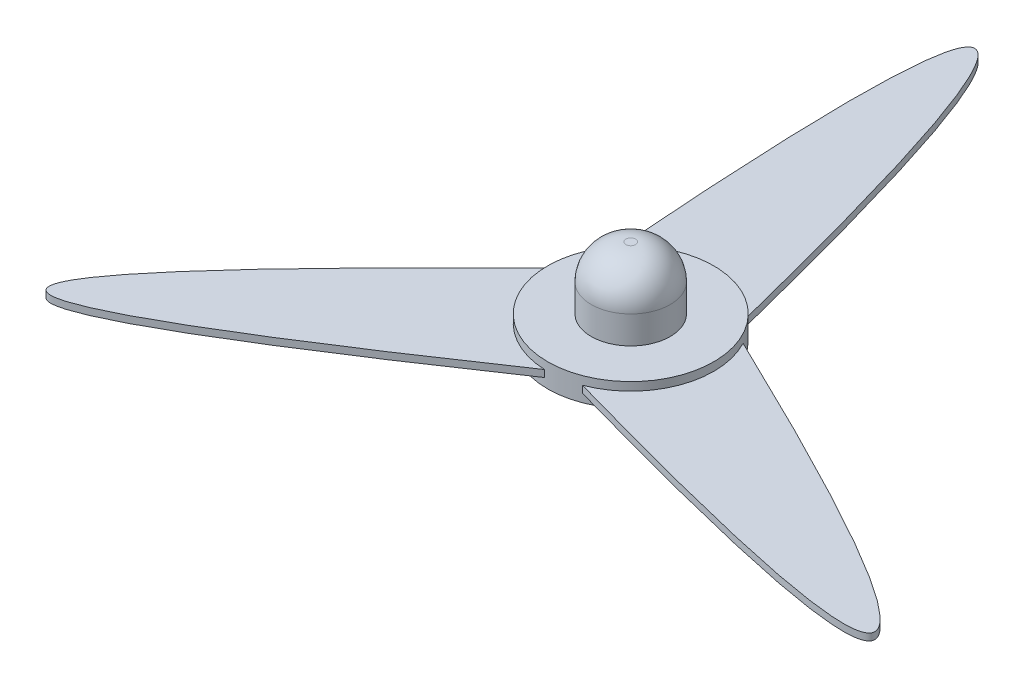
ISO-10303-21;
HEADER;
FILE_DESCRIPTION(('STEP AP214'),'2;1');
FILE_NAME('part.step','',(''),(''),'','','');
FILE_SCHEMA(('AUTOMOTIVE_DESIGN { 1 0 10303 214 1 1 1 1 }'));
ENDSEC;
DATA;
#1=APPLICATION_CONTEXT('core data for automotive mechanical design processes');
#2=APPLICATION_PROTOCOL_DEFINITION('international standard','automotive_design',2000,#1);
#3=PRODUCT_CONTEXT('',#1,'mechanical');
#4=PRODUCT('Part','Part','',(#3));
#5=PRODUCT_RELATED_PRODUCT_CATEGORY('part','',(#4));
#6=PRODUCT_DEFINITION_FORMATION('','',#4);
#7=PRODUCT_DEFINITION_CONTEXT('part definition',#1,'design');
#8=PRODUCT_DEFINITION('design','',#6,#7);
#9=PRODUCT_DEFINITION_SHAPE('','',#8);
#10=(LENGTH_UNIT() NAMED_UNIT(*) SI_UNIT(.MILLI.,.METRE.));
#11=(NAMED_UNIT(*) PLANE_ANGLE_UNIT() SI_UNIT($,.RADIAN.));
#12=(NAMED_UNIT(*) SI_UNIT($,.STERADIAN.) SOLID_ANGLE_UNIT());
#13=UNCERTAINTY_MEASURE_WITH_UNIT(LENGTH_MEASURE(1.E-05),#10,'distance_accuracy_value','');
#14=(GEOMETRIC_REPRESENTATION_CONTEXT(3) GLOBAL_UNCERTAINTY_ASSIGNED_CONTEXT((#13)) GLOBAL_UNIT_ASSIGNED_CONTEXT((#10,
#11,#12)) REPRESENTATION_CONTEXT('',''));
#15=CARTESIAN_POINT('',(0.,0.,0.));
#16=DIRECTION('',(0.,0.,1.));
#17=DIRECTION('',(1.,0.,0.));
#18=AXIS2_PLACEMENT_3D('',#15,#16,#17);
#19=CARTESIAN_POINT('',(0.,28.5,0.));
#20=DIRECTION('',(0.,1.,0.));
#21=DIRECTION('',(0.,0.,1.));
#22=AXIS2_PLACEMENT_3D('',#19,#20,#21);
#23=DEGENERATE_TOROIDAL_SURFACE('',#22,3.5,25.,.T.);
#24=CARTESIAN_POINT('',(0.,53.5,0.));
#25=DIRECTION('',(0.,1.,0.));
#26=DIRECTION('',(0.,0.,1.));
#27=AXIS2_PLACEMENT_3D('',#24,#25,#26);
#28=CIRCLE('',#27,3.5);
#29=CARTESIAN_POINT('',(0.,53.5,3.5));
#30=VERTEX_POINT('',#29);
#31=EDGE_CURVE('E44',#30,#30,#28,.T.);
#32=ORIENTED_EDGE('',*,*,#31,.F.);
#33=EDGE_LOOP('',(#32));
#34=FACE_BOUND('',#33,.T.);
#35=CARTESIAN_POINT('',(0.,28.5,0.));
#36=DIRECTION('',(0.,1.,0.));
#37=DIRECTION('',(0.,0.,1.));
#38=AXIS2_PLACEMENT_3D('',#35,#36,#37);
#39=CIRCLE('',#38,28.5);
#40=CARTESIAN_POINT('',(0.,28.5,28.5));
#41=VERTEX_POINT('',#40);
#42=EDGE_CURVE('E11',#41,#41,#39,.F.);
#43=ORIENTED_EDGE('',*,*,#42,.F.);
#44=EDGE_LOOP('',(#43));
#45=FACE_BOUND('',#44,.T.);
#46=ADVANCED_FACE('F37',(#34,#45),#23,.T.);
#47=CARTESIAN_POINT('',(0.,8.5,0.));
#48=DIRECTION('',(0.,1.,0.));
#49=DIRECTION('',(0.,0.,1.));
#50=AXIS2_PLACEMENT_3D('',#47,#48,#49);
#51=PLANE('',#50);
#52=CARTESIAN_POINT('',(0.,8.5,0.));
#53=DIRECTION('',(0.,1.,0.));
#54=DIRECTION('',(0.,0.,1.));
#55=AXIS2_PLACEMENT_3D('',#52,#53,#54);
#56=CIRCLE('',#55,60.);
#57=CARTESIAN_POINT('',(0.,8.5,60.));
#58=VERTEX_POINT('',#57);
#59=EDGE_CURVE('E190',#58,#58,#56,.T.);
#60=ORIENTED_EDGE('',*,*,#59,.T.);
#61=EDGE_LOOP('',(#60));
#62=FACE_BOUND('',#61,.T.);
#63=CARTESIAN_POINT('',(0.,8.5,0.));
#64=DIRECTION('',(0.,1.,0.));
#65=DIRECTION('',(0.,0.,1.));
#66=AXIS2_PLACEMENT_3D('',#63,#64,#65);
#67=CIRCLE('',#66,28.5);
#68=CARTESIAN_POINT('',(0.,8.5,28.5));
#69=VERTEX_POINT('',#68);
#70=EDGE_CURVE('E188',#69,#69,#67,.T.);
#71=ORIENTED_EDGE('',*,*,#70,.F.);
#72=EDGE_LOOP('',(#71));
#73=FACE_BOUND('',#72,.T.);
#74=ADVANCED_FACE('F169',(#62,#73),#51,.T.);
#75=CARTESIAN_POINT('',(0.,-2.5,0.));
#76=DIRECTION('',(0.,1.,0.));
#77=DIRECTION('',(0.,0.,1.));
#78=AXIS2_PLACEMENT_3D('',#75,#76,#77);
#79=PLANE('',#78);
#80=CARTESIAN_POINT('',(53.0354286217138,-2.5,-28.0578564917405));
#81=CARTESIAN_POINT('',(524.10841495073,-2.5,198.146021354634));
#82=CARTESIAN_POINT('',(21.2083628967925,-2.5,56.126690114757));
#83=B_SPLINE_CURVE_WITH_KNOTS('',2,(#80,#81,#82),.UNSPECIFIED.,.F.,.F.,(3,3),(0.,1.),.UNSPECIFIED.);
#84=CARTESIAN_POINT('',(53.0354286217138,-2.5,-28.0578564917405));
#85=VERTEX_POINT('',#84);
#86=CARTESIAN_POINT('',(21.2083628967925,-2.5,56.126690114757));
#87=VERTEX_POINT('',#86);
#88=EDGE_CURVE('E135',#85,#87,#83,.T.);
#89=ORIENTED_EDGE('',*,*,#88,.T.);
#90=CARTESIAN_POINT('',(0.,-2.5,0.));
#91=DIRECTION('',(0.,1.,0.));
#92=DIRECTION('',(0.,0.,1.));
#93=AXIS2_PLACEMENT_3D('',#90,#91,#92);
#94=CIRCLE('',#93,60.);
#95=EDGE_CURVE('E51',#87,#85,#94,.T.);
#96=ORIENTED_EDGE('',*,*,#95,.T.);
#97=EDGE_LOOP('',(#89,#96));
#98=FACE_BOUND('',#97,.T.);
#99=ADVANCED_FACE('F166',(#98),#79,.F.);
#100=CARTESIAN_POINT('',(-50.8165308084424,-2.5,-31.90110024113));
#101=CARTESIAN_POINT('',(-90.4547193234407,-2.5,-552.964212361844));
#102=CARTESIAN_POINT('',(38.00295802132,-2.5,-46.4303260986803));
#103=B_SPLINE_CURVE_WITH_KNOTS('',2,(#100,#101,#102),.UNSPECIFIED.,.F.,.F.,(3,3),(0.,1.),.UNSPECIFIED.);
#104=CARTESIAN_POINT('',(-50.8165308084424,-2.5,-31.90110024113));
#105=VERTEX_POINT('',#104);
#106=CARTESIAN_POINT('',(38.00295802132,-2.5,-46.4303260986803));
#107=VERTEX_POINT('',#106);
#108=EDGE_CURVE('E124',#105,#107,#103,.T.);
#109=ORIENTED_EDGE('',*,*,#108,.T.);
#110=EDGE_CURVE('E205',#107,#105,#94,.T.);
#111=ORIENTED_EDGE('',*,*,#110,.T.);
#112=EDGE_LOOP('',(#109,#111));
#113=FACE_BOUND('',#112,.T.);
#114=ADVANCED_FACE('F167',(#113),#79,.F.);
#115=CARTESIAN_POINT('',(0.,2.5,0.));
#116=DIRECTION('',(0.,1.,0.));
#117=DIRECTION('',(0.,0.,1.));
#118=AXIS2_PLACEMENT_3D('',#115,#116,#117);
#119=PLANE('',#118);
#120=CARTESIAN_POINT('',(0.,2.5,0.));
#121=DIRECTION('',(0.,1.,0.));
#122=DIRECTION('',(0.,0.,1.));
#123=AXIS2_PLACEMENT_3D('',#120,#121,#122);
#124=CIRCLE('',#123,60.);
#125=CARTESIAN_POINT('',(21.2083628967925,2.5,56.126690114757));
#126=VERTEX_POINT('',#125);
#127=CARTESIAN_POINT('',(53.0354286217138,2.5,-28.0578564917405));
#128=VERTEX_POINT('',#127);
#129=EDGE_CURVE('E105',#126,#128,#124,.T.);
#130=ORIENTED_EDGE('',*,*,#129,.F.);
#131=CARTESIAN_POINT('',(53.0354286217138,2.5,-28.0578564917405));
#132=CARTESIAN_POINT('',(524.10841495073,2.5,198.146021354634));
#133=CARTESIAN_POINT('',(21.2083628967925,2.5,56.126690114757));
#134=B_SPLINE_CURVE_WITH_KNOTS('',2,(#131,#132,#133),.UNSPECIFIED.,.F.,.F.,(3,3),(0.,1.),.UNSPECIFIED.);
#135=EDGE_CURVE('E92',#128,#126,#134,.T.);
#136=ORIENTED_EDGE('',*,*,#135,.F.);
#137=EDGE_LOOP('',(#130,#136));
#138=FACE_BOUND('',#137,.T.);
#139=ADVANCED_FACE('F108',(#138),#119,.T.);
#140=CARTESIAN_POINT('',(38.00295802132,2.5,-46.4303260986803));
#141=VERTEX_POINT('',#140);
#142=CARTESIAN_POINT('',(-50.8165308084424,2.5,-31.90110024113));
#143=VERTEX_POINT('',#142);
#144=EDGE_CURVE('E109',#141,#143,#124,.T.);
#145=ORIENTED_EDGE('',*,*,#144,.F.);
#146=CARTESIAN_POINT('',(-50.8165308084424,2.5,-31.90110024113));
#147=CARTESIAN_POINT('',(-90.4547193234407,2.5,-552.964212361844));
#148=CARTESIAN_POINT('',(38.00295802132,2.5,-46.4303260986803));
#149=B_SPLINE_CURVE_WITH_KNOTS('',2,(#146,#147,#148),.UNSPECIFIED.,.F.,.F.,(3,3),(0.,1.),.UNSPECIFIED.);
#150=EDGE_CURVE('E100',#143,#141,#149,.T.);
#151=ORIENTED_EDGE('',*,*,#150,.F.);
#152=EDGE_LOOP('',(#145,#151));
#153=FACE_BOUND('',#152,.T.);
#154=ADVANCED_FACE('F223',(#153),#119,.T.);
#155=DIRECTION('',(0.,1.,0.));
#156=VECTOR('',#155,1.);
#157=SURFACE_OF_LINEAR_EXTRUSION('',#103,#156);
#158=DIRECTION('',(0.,1.,0.));
#159=VECTOR('',#158,1.);
#160=CARTESIAN_POINT('',(-50.8165308084424,-2.5,-31.90110024113));
#161=LINE('',#160,#159);
#162=EDGE_CURVE('E59',#105,#143,#161,.T.);
#163=ORIENTED_EDGE('',*,*,#162,.T.);
#164=ORIENTED_EDGE('',*,*,#150,.T.);
#165=DIRECTION('',(0.,1.,0.));
#166=VECTOR('',#165,1.);
#167=CARTESIAN_POINT('',(38.00295802132,-2.5,-46.4303260986803));
#168=LINE('',#167,#166);
#169=EDGE_CURVE('E119',#107,#141,#168,.T.);
#170=ORIENTED_EDGE('',*,*,#169,.F.);
#171=ORIENTED_EDGE('',*,*,#108,.F.);
#172=EDGE_LOOP('',(#163,#164,#170,#171));
#173=FACE_BOUND('',#172,.T.);
#174=ADVANCED_FACE('F221',(#173),#157,.F.);
#175=CARTESIAN_POINT('',(0.,-2.5,0.));
#176=DIRECTION('',(0.,1.,0.));
#177=DIRECTION('',(0.,0.,1.));
#178=AXIS2_PLACEMENT_3D('',#175,#176,#177);
#179=CYLINDRICAL_SURFACE('',#178,60.);
#180=ORIENTED_EDGE('',*,*,#110,.F.);
#181=ORIENTED_EDGE('',*,*,#169,.T.);
#182=ORIENTED_EDGE('',*,*,#144,.T.);
#183=ORIENTED_EDGE('',*,*,#162,.F.);
#184=EDGE_LOOP('',(#180,#181,#182,#183));
#185=FACE_BOUND('',#184,.T.);
#186=CARTESIAN_POINT('',(-59.2113209181126,-2.5,-9.69636401607717));
#187=VERTEX_POINT('',#186);
#188=CARTESIAN_POINT('',(-2.21889781327181,-2.5,59.9589567328707));
#189=VERTEX_POINT('',#188);
#190=EDGE_CURVE('E203',#187,#189,#94,.T.);
#191=ORIENTED_EDGE('',*,*,#190,.F.);
#192=DIRECTION('',(0.,1.,0.));
#193=VECTOR('',#192,1.);
#194=CARTESIAN_POINT('',(-59.2113209181127,-2.5,-9.69636401607717));
#195=LINE('',#194,#193);
#196=CARTESIAN_POINT('',(-59.2113209181127,2.5,-9.69636401607717));
#197=VERTEX_POINT('',#196);
#198=EDGE_CURVE('E131',#187,#197,#195,.T.);
#199=ORIENTED_EDGE('',*,*,#198,.T.);
#200=CARTESIAN_POINT('',(-2.21889781327181,2.5,59.9589567328707));
#201=VERTEX_POINT('',#200);
#202=EDGE_CURVE('E111',#197,#201,#124,.T.);
#203=ORIENTED_EDGE('',*,*,#202,.T.);
#204=DIRECTION('',(0.,1.,0.));
#205=VECTOR('',#204,1.);
#206=CARTESIAN_POINT('',(-2.21889781327181,-2.5,59.9589567328707));
#207=LINE('',#206,#205);
#208=EDGE_CURVE('E106',#189,#201,#207,.T.);
#209=ORIENTED_EDGE('',*,*,#208,.F.);
#210=EDGE_LOOP('',(#191,#199,#203,#209));
#211=FACE_BOUND('',#210,.T.);
#212=DIRECTION('',(0.,1.,0.));
#213=VECTOR('',#212,1.);
#214=CARTESIAN_POINT('',(53.0354286217138,-2.5,-28.0578564917405));
#215=LINE('',#214,#213);
#216=EDGE_CURVE('E96',#85,#128,#215,.T.);
#217=ORIENTED_EDGE('',*,*,#216,.F.);
#218=ORIENTED_EDGE('',*,*,#95,.F.);
#219=DIRECTION('',(0.,1.,0.));
#220=VECTOR('',#219,1.);
#221=CARTESIAN_POINT('',(21.2083628967925,-2.5,56.126690114757));
#222=LINE('',#221,#220);
#223=EDGE_CURVE('E95',#87,#126,#222,.T.);
#224=ORIENTED_EDGE('',*,*,#223,.T.);
#225=ORIENTED_EDGE('',*,*,#129,.T.);
#226=EDGE_LOOP('',(#217,#218,#224,#225));
#227=FACE_BOUND('',#226,.T.);
#228=ORIENTED_EDGE('',*,*,#59,.F.);
#229=EDGE_LOOP('',(#228));
#230=FACE_BOUND('',#229,.T.);
#231=CARTESIAN_POINT('',(0.,-8.5,0.));
#232=DIRECTION('',(0.,1.,0.));
#233=DIRECTION('',(0.,0.,1.));
#234=AXIS2_PLACEMENT_3D('',#231,#232,#233);
#235=CIRCLE('',#234,60.);
#236=CARTESIAN_POINT('',(0.,-8.5,60.));
#237=VERTEX_POINT('',#236);
#238=EDGE_CURVE('E194',#237,#237,#235,.T.);
#239=ORIENTED_EDGE('',*,*,#238,.T.);
#240=EDGE_LOOP('',(#239));
#241=FACE_BOUND('',#240,.T.);
#242=ADVANCED_FACE('F103',(#185,#211,#227,#230,#241),#179,.T.);
#243=DIRECTION('',(0.,1.,0.));
#244=VECTOR('',#243,1.);
#245=SURFACE_OF_LINEAR_EXTRUSION('',#83,#244);
#246=ORIENTED_EDGE('',*,*,#216,.T.);
#247=ORIENTED_EDGE('',*,*,#135,.T.);
#248=ORIENTED_EDGE('',*,*,#223,.F.);
#249=ORIENTED_EDGE('',*,*,#88,.F.);
#250=EDGE_LOOP('',(#246,#247,#248,#249));
#251=FACE_BOUND('',#250,.T.);
#252=ADVANCED_FACE('F93',(#251),#245,.F.);
#253=CARTESIAN_POINT('',(-2.21889781327177,-2.5,59.9589567328707));
#254=CARTESIAN_POINT('',(-433.653695627293,-2.5,354.818191007209));
#255=CARTESIAN_POINT('',(-59.2113209181127,-2.5,-9.69636401607717));
#256=B_SPLINE_CURVE_WITH_KNOTS('',2,(#253,#254,#255),.UNSPECIFIED.,.F.,.F.,(3,3),(0.,1.),.UNSPECIFIED.);
#257=DIRECTION('',(0.,1.,0.));
#258=VECTOR('',#257,1.);
#259=SURFACE_OF_LINEAR_EXTRUSION('',#256,#258);
#260=ORIENTED_EDGE('',*,*,#208,.T.);
#261=CARTESIAN_POINT('',(-2.21889781327177,2.5,59.9589567328707));
#262=CARTESIAN_POINT('',(-433.653695627293,2.5,354.818191007209));
#263=CARTESIAN_POINT('',(-59.2113209181127,2.5,-9.69636401607717));
#264=B_SPLINE_CURVE_WITH_KNOTS('',2,(#261,#262,#263),.UNSPECIFIED.,.F.,.F.,(3,3),(0.,1.),.UNSPECIFIED.);
#265=EDGE_CURVE('E101',#201,#197,#264,.T.);
#266=ORIENTED_EDGE('',*,*,#265,.T.);
#267=ORIENTED_EDGE('',*,*,#198,.F.);
#268=EDGE_CURVE('E138',#189,#187,#256,.T.);
#269=ORIENTED_EDGE('',*,*,#268,.F.);
#270=EDGE_LOOP('',(#260,#266,#267,#269));
#271=FACE_BOUND('',#270,.T.);
#272=ADVANCED_FACE('F155',(#271),#259,.F.);
#273=ORIENTED_EDGE('',*,*,#268,.T.);
#274=ORIENTED_EDGE('',*,*,#190,.T.);
#275=EDGE_LOOP('',(#273,#274));
#276=FACE_BOUND('',#275,.T.);
#277=ADVANCED_FACE('F158',(#276),#79,.F.);
#278=ORIENTED_EDGE('',*,*,#202,.F.);
#279=ORIENTED_EDGE('',*,*,#265,.F.);
#280=EDGE_LOOP('',(#278,#279));
#281=FACE_BOUND('',#280,.T.);
#282=ADVANCED_FACE('F163',(#281),#119,.T.);
#283=CARTESIAN_POINT('',(0.,-8.5,0.));
#284=DIRECTION('',(0.,1.,0.));
#285=DIRECTION('',(0.,0.,1.));
#286=AXIS2_PLACEMENT_3D('',#283,#284,#285);
#287=PLANE('',#286);
#288=CARTESIAN_POINT('',(0.,-8.5,0.));
#289=DIRECTION('',(0.,-1.,0.));
#290=DIRECTION('',(0.,0.,-1.));
#291=AXIS2_PLACEMENT_3D('',#288,#289,#290);
#292=CIRCLE('',#291,24.);
#293=CARTESIAN_POINT('',(0.,-8.5,-24.));
#294=VERTEX_POINT('',#293);
#295=EDGE_CURVE('E197',#294,#294,#292,.T.);
#296=ORIENTED_EDGE('',*,*,#295,.F.);
#297=EDGE_LOOP('',(#296));
#298=FACE_BOUND('',#297,.T.);
#299=ORIENTED_EDGE('',*,*,#238,.F.);
#300=EDGE_LOOP('',(#299));
#301=FACE_BOUND('',#300,.T.);
#302=ADVANCED_FACE('F184',(#298,#301),#287,.F.);
#303=CARTESIAN_POINT('',(0.,53.5,0.));
#304=DIRECTION('',(0.,-1.,0.));
#305=DIRECTION('',(0.,0.,-1.));
#306=AXIS2_PLACEMENT_3D('',#303,#304,#305);
#307=CYLINDRICAL_SURFACE('',#306,28.5);
#308=ORIENTED_EDGE('',*,*,#42,.T.);
#309=EDGE_LOOP('',(#308));
#310=FACE_BOUND('',#309,.T.);
#311=ORIENTED_EDGE('',*,*,#70,.T.);
#312=EDGE_LOOP('',(#311));
#313=FACE_BOUND('',#312,.T.);
#314=ADVANCED_FACE('F180',(#310,#313),#307,.T.);
#315=CARTESIAN_POINT('',(0.,53.5,0.));
#316=DIRECTION('',(0.,1.,0.));
#317=DIRECTION('',(0.,0.,1.));
#318=AXIS2_PLACEMENT_3D('',#315,#316,#317);
#319=PLANE('',#318);
#320=ORIENTED_EDGE('',*,*,#31,.T.);
#321=EDGE_LOOP('',(#320));
#322=FACE_BOUND('',#321,.T.);
#323=ADVANCED_FACE('F183',(#322),#319,.T.);
#324=CARTESIAN_POINT('',(0.,28.5,0.));
#325=DIRECTION('',(0.,-1.,0.));
#326=DIRECTION('',(0.,0.,-1.));
#327=AXIS2_PLACEMENT_3D('',#324,#325,#326);
#328=CYLINDRICAL_SURFACE('',#327,24.);
#329=CARTESIAN_POINT('',(0.,28.5,0.));
#330=DIRECTION('',(0.,-1.,0.));
#331=DIRECTION('',(0.,0.,-1.));
#332=AXIS2_PLACEMENT_3D('',#329,#330,#331);
#333=CIRCLE('',#332,24.);
#334=CARTESIAN_POINT('',(0.,28.5,-24.));
#335=VERTEX_POINT('',#334);
#336=EDGE_CURVE('E191',#335,#335,#333,.T.);
#337=ORIENTED_EDGE('',*,*,#336,.F.);
#338=EDGE_LOOP('',(#337));
#339=FACE_BOUND('',#338,.T.);
#340=ORIENTED_EDGE('',*,*,#295,.T.);
#341=EDGE_LOOP('',(#340));
#342=FACE_BOUND('',#341,.T.);
#343=ADVANCED_FACE('F293',(#339,#342),#328,.F.);
#344=CARTESIAN_POINT('',(0.,28.5,0.));
#345=DIRECTION('',(0.,-1.,0.));
#346=DIRECTION('',(0.,0.,-1.));
#347=AXIS2_PLACEMENT_3D('',#344,#345,#346);
#348=PLANE('',#347);
#349=ORIENTED_EDGE('',*,*,#336,.T.);
#350=EDGE_LOOP('',(#349));
#351=FACE_BOUND('',#350,.T.);
#352=ADVANCED_FACE('F307',(#351),#348,.T.);
#353=CLOSED_SHELL('',(#46,#74,#99,#114,#139,#154,#174,#242,#252,#272,#277,#282,#302,#314,#323,
#343,#352));
#354=MANIFOLD_SOLID_BREP('B2',#353);
#355=ADVANCED_BREP_SHAPE_REPRESENTATION('',(#18,#354),#14);
#356=SHAPE_DEFINITION_REPRESENTATION(#9,#355);
ENDSEC;
END-ISO-10303-21;
